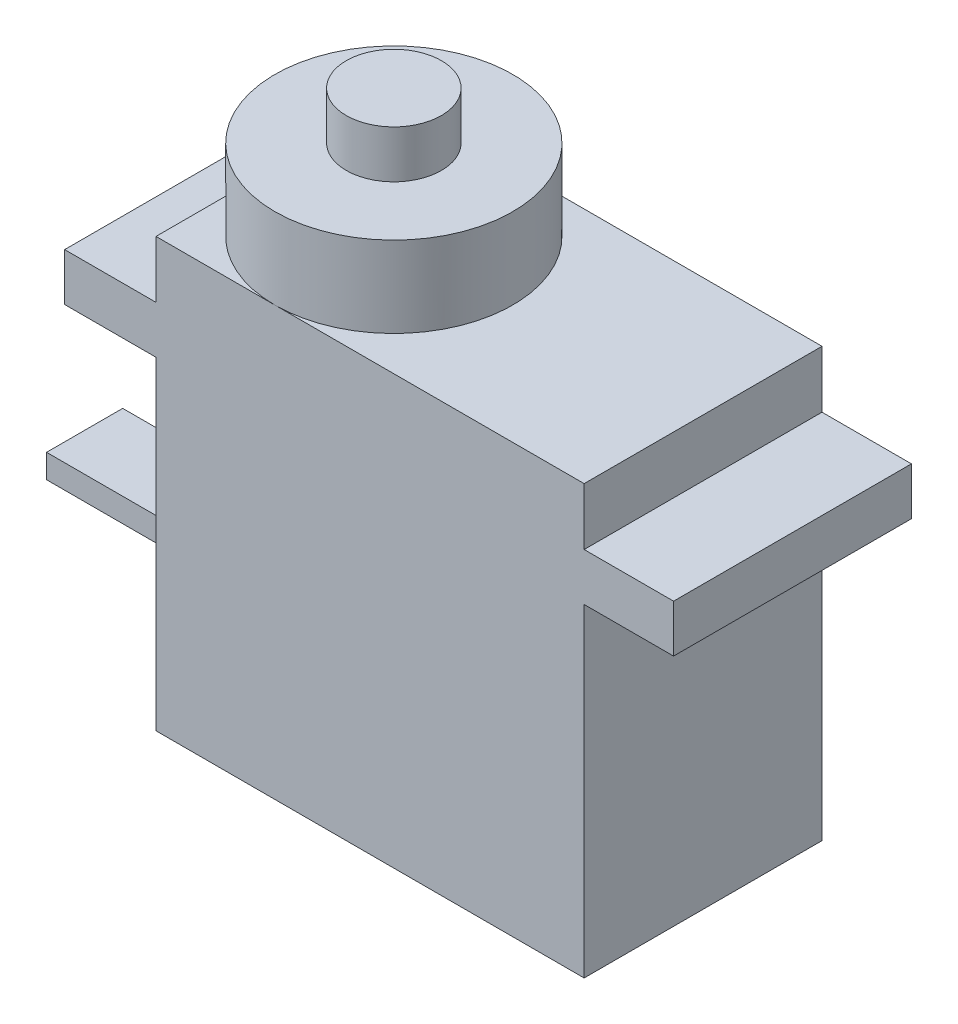
ISO-10303-21;
HEADER;
FILE_DESCRIPTION(('STEP AP214'),'2;1');
FILE_NAME('part.step','',(''),(''),'','','');
FILE_SCHEMA(('AUTOMOTIVE_DESIGN { 1 0 10303 214 1 1 1 1 }'));
ENDSEC;
DATA;
#1=APPLICATION_CONTEXT('core data for automotive mechanical design processes');
#2=APPLICATION_PROTOCOL_DEFINITION('international standard','automotive_design',2000,#1);
#3=PRODUCT_CONTEXT('',#1,'mechanical');
#4=PRODUCT('Part','Part','',(#3));
#5=PRODUCT_RELATED_PRODUCT_CATEGORY('part','',(#4));
#6=PRODUCT_DEFINITION_FORMATION('','',#4);
#7=PRODUCT_DEFINITION_CONTEXT('part definition',#1,'design');
#8=PRODUCT_DEFINITION('design','',#6,#7);
#9=PRODUCT_DEFINITION_SHAPE('','',#8);
#10=(LENGTH_UNIT() NAMED_UNIT(*) SI_UNIT(.MILLI.,.METRE.));
#11=(NAMED_UNIT(*) PLANE_ANGLE_UNIT() SI_UNIT($,.RADIAN.));
#12=(NAMED_UNIT(*) SI_UNIT($,.STERADIAN.) SOLID_ANGLE_UNIT());
#13=UNCERTAINTY_MEASURE_WITH_UNIT(LENGTH_MEASURE(1.E-05),#10,'distance_accuracy_value','');
#14=(GEOMETRIC_REPRESENTATION_CONTEXT(3) GLOBAL_UNCERTAINTY_ASSIGNED_CONTEXT((#13)) GLOBAL_UNIT_ASSIGNED_CONTEXT((#10,
#11,#12)) REPRESENTATION_CONTEXT('',''));
#15=CARTESIAN_POINT('',(0.,0.,0.));
#16=DIRECTION('',(0.,0.,1.));
#17=DIRECTION('',(1.,0.,0.));
#18=AXIS2_PLACEMENT_3D('',#15,#16,#17);
#19=CARTESIAN_POINT('',(0.,22.5,0.));
#20=DIRECTION('',(-1.,0.,0.));
#21=DIRECTION('',(0.,0.,1.));
#22=AXIS2_PLACEMENT_3D('',#19,#20,#21);
#23=PLANE('',#22);
#24=DIRECTION('',(0.,-1.,0.));
#25=VECTOR('',#24,1.);
#26=CARTESIAN_POINT('',(0.,22.5,0.));
#27=LINE('',#26,#25);
#28=CARTESIAN_POINT('',(0.,17.,0.));
#29=VERTEX_POINT('',#28);
#30=CARTESIAN_POINT('',(0.,0.,0.));
#31=VERTEX_POINT('',#30);
#32=EDGE_CURVE('E269',#29,#31,#27,.T.);
#33=ORIENTED_EDGE('',*,*,#32,.F.);
#34=DIRECTION('',(0.,0.,-1.));
#35=VECTOR('',#34,1.);
#36=CARTESIAN_POINT('',(0.,17.,0.));
#37=LINE('',#36,#35);
#38=CARTESIAN_POINT('',(0.,17.,-12.5));
#39=VERTEX_POINT('',#38);
#40=EDGE_CURVE('E247',#29,#39,#37,.T.);
#41=ORIENTED_EDGE('',*,*,#40,.T.);
#42=DIRECTION('',(0.,-1.,0.));
#43=VECTOR('',#42,1.);
#44=CARTESIAN_POINT('',(0.,22.5,-12.5));
#45=LINE('',#44,#43);
#46=CARTESIAN_POINT('',(0.,0.,-12.5));
#47=VERTEX_POINT('',#46);
#48=EDGE_CURVE('E284',#39,#47,#45,.T.);
#49=ORIENTED_EDGE('',*,*,#48,.T.);
#50=DIRECTION('',(0.,0.,-1.));
#51=VECTOR('',#50,1.);
#52=CARTESIAN_POINT('',(0.,0.,0.));
#53=LINE('',#52,#51);
#54=EDGE_CURVE('E278',#31,#47,#53,.T.);
#55=ORIENTED_EDGE('',*,*,#54,.F.);
#56=EDGE_LOOP('',(#33,#41,#49,#55));
#57=FACE_BOUND('',#56,.T.);
#58=DIRECTION('',(0.,0.,1.));
#59=VECTOR('',#58,1.);
#60=CARTESIAN_POINT('',(0.,4.3,-8.25));
#61=LINE('',#60,#59);
#62=CARTESIAN_POINT('',(0.,4.3,-8.25));
#63=VERTEX_POINT('',#62);
#64=CARTESIAN_POINT('',(0.,4.3,-4.25));
#65=VERTEX_POINT('',#64);
#66=EDGE_CURVE('E534',#63,#65,#61,.T.);
#67=ORIENTED_EDGE('',*,*,#66,.F.);
#68=DIRECTION('',(0.,-1.,0.));
#69=VECTOR('',#68,1.);
#70=CARTESIAN_POINT('',(0.,4.3,-8.25));
#71=LINE('',#70,#69);
#72=CARTESIAN_POINT('',(0.,5.55,-8.25));
#73=VERTEX_POINT('',#72);
#74=EDGE_CURVE('E187',#73,#63,#71,.T.);
#75=ORIENTED_EDGE('',*,*,#74,.F.);
#76=DIRECTION('',(0.,0.,-1.));
#77=VECTOR('',#76,1.);
#78=CARTESIAN_POINT('',(0.,5.55,-8.25));
#79=LINE('',#78,#77);
#80=CARTESIAN_POINT('',(0.,5.55,-4.25));
#81=VERTEX_POINT('',#80);
#82=EDGE_CURVE('E183',#81,#73,#79,.T.);
#83=ORIENTED_EDGE('',*,*,#82,.F.);
#84=DIRECTION('',(0.,1.,0.));
#85=VECTOR('',#84,1.);
#86=CARTESIAN_POINT('',(0.,4.3,-4.25));
#87=LINE('',#86,#85);
#88=EDGE_CURVE('E531',#65,#81,#87,.T.);
#89=ORIENTED_EDGE('',*,*,#88,.F.);
#90=EDGE_LOOP('',(#67,#75,#83,#89));
#91=FACE_BOUND('',#90,.T.);
#92=ADVANCED_FACE('F39',(#57,#91),#23,.T.);
#93=CARTESIAN_POINT('',(0.,22.5,0.));
#94=DIRECTION('',(0.,1.,0.));
#95=DIRECTION('',(0.,0.,1.));
#96=AXIS2_PLACEMENT_3D('',#93,#94,#95);
#97=PLANE('',#96);
#98=CARTESIAN_POINT('',(6.25,22.5,-6.25));
#99=DIRECTION('',(0.,1.,0.));
#100=DIRECTION('',(0.,0.,1.));
#101=AXIS2_PLACEMENT_3D('',#98,#99,#100);
#102=CIRCLE('',#101,6.25);
#103=CARTESIAN_POINT('',(6.25,22.5,0.));
#104=VERTEX_POINT('',#103);
#105=CARTESIAN_POINT('',(6.25,22.5,-12.5));
#106=VERTEX_POINT('',#105);
#107=EDGE_CURVE('E50',#104,#106,#102,.T.);
#108=ORIENTED_EDGE('',*,*,#107,.F.);
#109=DIRECTION('',(1.,0.,0.));
#110=VECTOR('',#109,1.);
#111=CARTESIAN_POINT('',(0.,22.5,0.));
#112=LINE('',#111,#110);
#113=CARTESIAN_POINT('',(22.5,22.5,0.));
#114=VERTEX_POINT('',#113);
#115=EDGE_CURVE('E258',#104,#114,#112,.T.);
#116=ORIENTED_EDGE('',*,*,#115,.T.);
#117=DIRECTION('',(0.,0.,-1.));
#118=VECTOR('',#117,1.);
#119=CARTESIAN_POINT('',(22.5,22.5,0.));
#120=LINE('',#119,#118);
#121=CARTESIAN_POINT('',(22.5,22.5,-12.5));
#122=VERTEX_POINT('',#121);
#123=EDGE_CURVE('E257',#114,#122,#120,.T.);
#124=ORIENTED_EDGE('',*,*,#123,.T.);
#125=DIRECTION('',(1.,0.,0.));
#126=VECTOR('',#125,1.);
#127=CARTESIAN_POINT('',(0.,22.5,-12.5));
#128=LINE('',#127,#126);
#129=EDGE_CURVE('E261',#106,#122,#128,.T.);
#130=ORIENTED_EDGE('',*,*,#129,.F.);
#131=EDGE_LOOP('',(#108,#116,#124,#130));
#132=FACE_BOUND('',#131,.T.);
#133=ADVANCED_FACE('F337',(#132),#97,.T.);
#134=CARTESIAN_POINT('',(0.,22.5,-6.25));
#135=VERTEX_POINT('',#134);
#136=EDGE_CURVE('E11',#106,#135,#102,.T.);
#137=ORIENTED_EDGE('',*,*,#136,.F.);
#138=CARTESIAN_POINT('',(0.,22.5,-12.5));
#139=VERTEX_POINT('',#138);
#140=EDGE_CURVE('E262',#139,#106,#128,.T.);
#141=ORIENTED_EDGE('',*,*,#140,.F.);
#142=DIRECTION('',(0.,0.,-1.));
#143=VECTOR('',#142,1.);
#144=CARTESIAN_POINT('',(0.,22.5,0.));
#145=LINE('',#144,#143);
#146=EDGE_CURVE('E265',#135,#139,#145,.T.);
#147=ORIENTED_EDGE('',*,*,#146,.F.);
#148=EDGE_LOOP('',(#137,#141,#147));
#149=FACE_BOUND('',#148,.T.);
#150=ADVANCED_FACE('F343',(#149),#97,.T.);
#151=CARTESIAN_POINT('',(22.5,22.5,0.));
#152=DIRECTION('',(-1.,0.,0.));
#153=DIRECTION('',(0.,0.,1.));
#154=AXIS2_PLACEMENT_3D('',#151,#152,#153);
#155=PLANE('',#154);
#156=DIRECTION('',(0.,0.,-1.));
#157=VECTOR('',#156,1.);
#158=CARTESIAN_POINT('',(22.5,17.,0.));
#159=LINE('',#158,#157);
#160=CARTESIAN_POINT('',(22.5,17.,0.));
#161=VERTEX_POINT('',#160);
#162=CARTESIAN_POINT('',(22.5,17.,-12.5));
#163=VERTEX_POINT('',#162);
#164=EDGE_CURVE('E205',#161,#163,#159,.T.);
#165=ORIENTED_EDGE('',*,*,#164,.F.);
#166=DIRECTION('',(0.,-1.,0.));
#167=VECTOR('',#166,1.);
#168=CARTESIAN_POINT('',(22.5,22.5,0.));
#169=LINE('',#168,#167);
#170=CARTESIAN_POINT('',(22.5,0.,0.));
#171=VERTEX_POINT('',#170);
#172=EDGE_CURVE('E290',#161,#171,#169,.T.);
#173=ORIENTED_EDGE('',*,*,#172,.T.);
#174=DIRECTION('',(0.,0.,-1.));
#175=VECTOR('',#174,1.);
#176=CARTESIAN_POINT('',(22.5,0.,0.));
#177=LINE('',#176,#175);
#178=CARTESIAN_POINT('',(22.5,0.,-12.5));
#179=VERTEX_POINT('',#178);
#180=EDGE_CURVE('E272',#171,#179,#177,.T.);
#181=ORIENTED_EDGE('',*,*,#180,.T.);
#182=DIRECTION('',(0.,-1.,0.));
#183=VECTOR('',#182,1.);
#184=CARTESIAN_POINT('',(22.5,22.5,-12.5));
#185=LINE('',#184,#183);
#186=EDGE_CURVE('E287',#163,#179,#185,.T.);
#187=ORIENTED_EDGE('',*,*,#186,.F.);
#188=EDGE_LOOP('',(#165,#173,#181,#187));
#189=FACE_BOUND('',#188,.T.);
#190=ADVANCED_FACE('F300',(#189),#155,.F.);
#191=CARTESIAN_POINT('',(0.,22.5,0.));
#192=DIRECTION('',(0.,0.,-1.));
#193=DIRECTION('',(-1.,0.,0.));
#194=AXIS2_PLACEMENT_3D('',#191,#192,#193);
#195=PLANE('',#194);
#196=DIRECTION('',(1.,0.,0.));
#197=VECTOR('',#196,1.);
#198=CARTESIAN_POINT('',(0.,0.,0.));
#199=LINE('',#198,#197);
#200=EDGE_CURVE('E254',#31,#171,#199,.T.);
#201=ORIENTED_EDGE('',*,*,#200,.T.);
#202=ORIENTED_EDGE('',*,*,#172,.F.);
#203=DIRECTION('',(1.,0.,0.));
#204=VECTOR('',#203,1.);
#205=CARTESIAN_POINT('',(0.,17.,0.));
#206=LINE('',#205,#204);
#207=CARTESIAN_POINT('',(27.2,17.,0.));
#208=VERTEX_POINT('',#207);
#209=EDGE_CURVE('E198',#161,#208,#206,.T.);
#210=ORIENTED_EDGE('',*,*,#209,.T.);
#211=DIRECTION('',(0.,-1.,0.));
#212=VECTOR('',#211,1.);
#213=CARTESIAN_POINT('',(27.2,19.5,0.));
#214=LINE('',#213,#212);
#215=CARTESIAN_POINT('',(27.2,19.5,0.));
#216=VERTEX_POINT('',#215);
#217=EDGE_CURVE('E225',#216,#208,#214,.T.);
#218=ORIENTED_EDGE('',*,*,#217,.F.);
#219=DIRECTION('',(1.,0.,0.));
#220=VECTOR('',#219,1.);
#221=CARTESIAN_POINT('',(0.,19.5,0.));
#222=LINE('',#221,#220);
#223=CARTESIAN_POINT('',(22.5,19.5,0.));
#224=VERTEX_POINT('',#223);
#225=EDGE_CURVE('E201',#224,#216,#222,.T.);
#226=ORIENTED_EDGE('',*,*,#225,.F.);
#227=EDGE_CURVE('E291',#114,#224,#169,.T.);
#228=ORIENTED_EDGE('',*,*,#227,.F.);
#229=ORIENTED_EDGE('',*,*,#115,.F.);
#230=CARTESIAN_POINT('',(0.,22.5,0.));
#231=VERTEX_POINT('',#230);
#232=EDGE_CURVE('E255',#231,#104,#112,.T.);
#233=ORIENTED_EDGE('',*,*,#232,.F.);
#234=CARTESIAN_POINT('',(0.,19.5,0.));
#235=VERTEX_POINT('',#234);
#236=EDGE_CURVE('E281',#231,#235,#27,.T.);
#237=ORIENTED_EDGE('',*,*,#236,.T.);
#238=DIRECTION('',(-1.,0.,0.));
#239=VECTOR('',#238,1.);
#240=CARTESIAN_POINT('',(0.,19.5,0.));
#241=LINE('',#240,#239);
#242=CARTESIAN_POINT('',(-4.8,19.5,0.));
#243=VERTEX_POINT('',#242);
#244=EDGE_CURVE('E232',#235,#243,#241,.T.);
#245=ORIENTED_EDGE('',*,*,#244,.T.);
#246=DIRECTION('',(0.,-1.,0.));
#247=VECTOR('',#246,1.);
#248=CARTESIAN_POINT('',(-4.8,19.5,0.));
#249=LINE('',#248,#247);
#250=CARTESIAN_POINT('',(-4.8,17.,0.));
#251=VERTEX_POINT('',#250);
#252=EDGE_CURVE('E252',#243,#251,#249,.T.);
#253=ORIENTED_EDGE('',*,*,#252,.T.);
#254=DIRECTION('',(-1.,0.,0.));
#255=VECTOR('',#254,1.);
#256=CARTESIAN_POINT('',(0.,17.,0.));
#257=LINE('',#256,#255);
#258=EDGE_CURVE('E244',#29,#251,#257,.T.);
#259=ORIENTED_EDGE('',*,*,#258,.F.);
#260=ORIENTED_EDGE('',*,*,#32,.T.);
#261=EDGE_LOOP('',(#201,#202,#210,#218,#226,#228,#229,#233,#237,#245,#253,#259,#260));
#262=FACE_BOUND('',#261,.T.);
#263=ADVANCED_FACE('F41',(#262),#195,.F.);
#264=ORIENTED_EDGE('',*,*,#227,.T.);
#265=DIRECTION('',(0.,0.,-1.));
#266=VECTOR('',#265,1.);
#267=CARTESIAN_POINT('',(22.5,19.5,0.));
#268=LINE('',#267,#266);
#269=CARTESIAN_POINT('',(22.5,19.5,-12.5));
#270=VERTEX_POINT('',#269);
#271=EDGE_CURVE('E210',#224,#270,#268,.T.);
#272=ORIENTED_EDGE('',*,*,#271,.T.);
#273=EDGE_CURVE('E288',#122,#270,#185,.T.);
#274=ORIENTED_EDGE('',*,*,#273,.F.);
#275=ORIENTED_EDGE('',*,*,#123,.F.);
#276=EDGE_LOOP('',(#264,#272,#274,#275));
#277=FACE_BOUND('',#276,.T.);
#278=ADVANCED_FACE('F331',(#277),#155,.F.);
#279=CARTESIAN_POINT('',(0.,22.5,-12.5));
#280=DIRECTION('',(0.,0.,-1.));
#281=DIRECTION('',(-1.,0.,0.));
#282=AXIS2_PLACEMENT_3D('',#279,#280,#281);
#283=PLANE('',#282);
#284=DIRECTION('',(1.,0.,0.));
#285=VECTOR('',#284,1.);
#286=CARTESIAN_POINT('',(0.,0.,-12.5));
#287=LINE('',#286,#285);
#288=EDGE_CURVE('E275',#47,#179,#287,.T.);
#289=ORIENTED_EDGE('',*,*,#288,.F.);
#290=ORIENTED_EDGE('',*,*,#48,.F.);
#291=DIRECTION('',(-1.,0.,0.));
#292=VECTOR('',#291,1.);
#293=CARTESIAN_POINT('',(0.,17.,-12.5));
#294=LINE('',#293,#292);
#295=CARTESIAN_POINT('',(-4.8,17.,-12.5));
#296=VERTEX_POINT('',#295);
#297=EDGE_CURVE('E233',#39,#296,#294,.T.);
#298=ORIENTED_EDGE('',*,*,#297,.T.);
#299=DIRECTION('',(0.,-1.,0.));
#300=VECTOR('',#299,1.);
#301=CARTESIAN_POINT('',(-4.8,19.5,-12.5));
#302=LINE('',#301,#300);
#303=CARTESIAN_POINT('',(-4.8,19.5,-12.5));
#304=VERTEX_POINT('',#303);
#305=EDGE_CURVE('E241',#304,#296,#302,.T.);
#306=ORIENTED_EDGE('',*,*,#305,.F.);
#307=DIRECTION('',(-1.,0.,0.));
#308=VECTOR('',#307,1.);
#309=CARTESIAN_POINT('',(0.,19.5,-12.5));
#310=LINE('',#309,#308);
#311=CARTESIAN_POINT('',(0.,19.5,-12.5));
#312=VERTEX_POINT('',#311);
#313=EDGE_CURVE('E239',#312,#304,#310,.T.);
#314=ORIENTED_EDGE('',*,*,#313,.F.);
#315=EDGE_CURVE('E285',#139,#312,#45,.T.);
#316=ORIENTED_EDGE('',*,*,#315,.F.);
#317=ORIENTED_EDGE('',*,*,#140,.T.);
#318=ORIENTED_EDGE('',*,*,#129,.T.);
#319=ORIENTED_EDGE('',*,*,#273,.T.);
#320=DIRECTION('',(1.,0.,0.));
#321=VECTOR('',#320,1.);
#322=CARTESIAN_POINT('',(0.,19.5,-12.5));
#323=LINE('',#322,#321);
#324=CARTESIAN_POINT('',(27.2,19.5,-12.5));
#325=VERTEX_POINT('',#324);
#326=EDGE_CURVE('E207',#270,#325,#323,.T.);
#327=ORIENTED_EDGE('',*,*,#326,.T.);
#328=DIRECTION('',(0.,-1.,0.));
#329=VECTOR('',#328,1.);
#330=CARTESIAN_POINT('',(27.2,19.5,-12.5));
#331=LINE('',#330,#329);
#332=CARTESIAN_POINT('',(27.2,17.,-12.5));
#333=VERTEX_POINT('',#332);
#334=EDGE_CURVE('E213',#325,#333,#331,.T.);
#335=ORIENTED_EDGE('',*,*,#334,.T.);
#336=DIRECTION('',(1.,0.,0.));
#337=VECTOR('',#336,1.);
#338=CARTESIAN_POINT('',(0.,17.,-12.5));
#339=LINE('',#338,#337);
#340=EDGE_CURVE('E219',#163,#333,#339,.T.);
#341=ORIENTED_EDGE('',*,*,#340,.F.);
#342=ORIENTED_EDGE('',*,*,#186,.T.);
#343=EDGE_LOOP('',(#289,#290,#298,#306,#314,#316,#317,#318,#319,#327,#335,#341,#342));
#344=FACE_BOUND('',#343,.T.);
#345=ADVANCED_FACE('F319',(#344),#283,.T.);
#346=DIRECTION('',(0.,0.,-1.));
#347=VECTOR('',#346,1.);
#348=CARTESIAN_POINT('',(0.,19.5,0.));
#349=LINE('',#348,#347);
#350=EDGE_CURVE('E236',#235,#312,#349,.T.);
#351=ORIENTED_EDGE('',*,*,#350,.F.);
#352=ORIENTED_EDGE('',*,*,#236,.F.);
#353=EDGE_CURVE('E266',#231,#135,#145,.T.);
#354=ORIENTED_EDGE('',*,*,#353,.T.);
#355=ORIENTED_EDGE('',*,*,#146,.T.);
#356=ORIENTED_EDGE('',*,*,#315,.T.);
#357=EDGE_LOOP('',(#351,#352,#354,#355,#356));
#358=FACE_BOUND('',#357,.T.);
#359=ADVANCED_FACE('F345',(#358),#23,.T.);
#360=EDGE_CURVE('E48',#135,#104,#102,.T.);
#361=ORIENTED_EDGE('',*,*,#360,.F.);
#362=ORIENTED_EDGE('',*,*,#353,.F.);
#363=ORIENTED_EDGE('',*,*,#232,.T.);
#364=EDGE_LOOP('',(#361,#362,#363));
#365=FACE_BOUND('',#364,.T.);
#366=ADVANCED_FACE('F346',(#365),#97,.T.);
#367=CARTESIAN_POINT('',(0.,0.,0.));
#368=DIRECTION('',(0.,1.,0.));
#369=DIRECTION('',(0.,0.,1.));
#370=AXIS2_PLACEMENT_3D('',#367,#368,#369);
#371=PLANE('',#370);
#372=ORIENTED_EDGE('',*,*,#200,.F.);
#373=ORIENTED_EDGE('',*,*,#54,.T.);
#374=ORIENTED_EDGE('',*,*,#288,.T.);
#375=ORIENTED_EDGE('',*,*,#180,.F.);
#376=EDGE_LOOP('',(#372,#373,#374,#375));
#377=FACE_BOUND('',#376,.T.);
#378=ADVANCED_FACE('F305',(#377),#371,.F.);
#379=CARTESIAN_POINT('',(-4.8,19.5,0.));
#380=DIRECTION('',(-1.,0.,0.));
#381=DIRECTION('',(0.,0.,1.));
#382=AXIS2_PLACEMENT_3D('',#379,#380,#381);
#383=PLANE('',#382);
#384=DIRECTION('',(0.,0.,-1.));
#385=VECTOR('',#384,1.);
#386=CARTESIAN_POINT('',(-4.8,17.,0.));
#387=LINE('',#386,#385);
#388=EDGE_CURVE('E228',#251,#296,#387,.T.);
#389=ORIENTED_EDGE('',*,*,#388,.F.);
#390=ORIENTED_EDGE('',*,*,#252,.F.);
#391=DIRECTION('',(0.,0.,-1.));
#392=VECTOR('',#391,1.);
#393=CARTESIAN_POINT('',(-4.8,19.5,0.));
#394=LINE('',#393,#392);
#395=EDGE_CURVE('E229',#243,#304,#394,.T.);
#396=ORIENTED_EDGE('',*,*,#395,.T.);
#397=ORIENTED_EDGE('',*,*,#305,.T.);
#398=EDGE_LOOP('',(#389,#390,#396,#397));
#399=FACE_BOUND('',#398,.T.);
#400=ADVANCED_FACE('F354',(#399),#383,.T.);
#401=CARTESIAN_POINT('',(0.,19.5,0.));
#402=DIRECTION('',(0.,1.,0.));
#403=DIRECTION('',(0.,0.,1.));
#404=AXIS2_PLACEMENT_3D('',#401,#402,#403);
#405=PLANE('',#404);
#406=ORIENTED_EDGE('',*,*,#395,.F.);
#407=ORIENTED_EDGE('',*,*,#244,.F.);
#408=ORIENTED_EDGE('',*,*,#350,.T.);
#409=ORIENTED_EDGE('',*,*,#313,.T.);
#410=EDGE_LOOP('',(#406,#407,#408,#409));
#411=FACE_BOUND('',#410,.T.);
#412=ADVANCED_FACE('F397',(#411),#405,.T.);
#413=CARTESIAN_POINT('',(0.,17.,0.));
#414=DIRECTION('',(0.,1.,0.));
#415=DIRECTION('',(0.,0.,1.));
#416=AXIS2_PLACEMENT_3D('',#413,#414,#415);
#417=PLANE('',#416);
#418=ORIENTED_EDGE('',*,*,#388,.T.);
#419=ORIENTED_EDGE('',*,*,#297,.F.);
#420=ORIENTED_EDGE('',*,*,#40,.F.);
#421=ORIENTED_EDGE('',*,*,#258,.T.);
#422=EDGE_LOOP('',(#418,#419,#420,#421));
#423=FACE_BOUND('',#422,.T.);
#424=ADVANCED_FACE('F315',(#423),#417,.F.);
#425=CARTESIAN_POINT('',(27.2,19.5,0.));
#426=DIRECTION('',(-1.,0.,0.));
#427=DIRECTION('',(0.,0.,1.));
#428=AXIS2_PLACEMENT_3D('',#425,#426,#427);
#429=PLANE('',#428);
#430=DIRECTION('',(0.,0.,-1.));
#431=VECTOR('',#430,1.);
#432=CARTESIAN_POINT('',(27.2,17.,0.));
#433=LINE('',#432,#431);
#434=EDGE_CURVE('E216',#208,#333,#433,.T.);
#435=ORIENTED_EDGE('',*,*,#434,.T.);
#436=ORIENTED_EDGE('',*,*,#334,.F.);
#437=DIRECTION('',(0.,0.,-1.));
#438=VECTOR('',#437,1.);
#439=CARTESIAN_POINT('',(27.2,19.5,0.));
#440=LINE('',#439,#438);
#441=EDGE_CURVE('E204',#216,#325,#440,.T.);
#442=ORIENTED_EDGE('',*,*,#441,.F.);
#443=ORIENTED_EDGE('',*,*,#217,.T.);
#444=EDGE_LOOP('',(#435,#436,#442,#443));
#445=FACE_BOUND('',#444,.T.);
#446=ADVANCED_FACE('F327',(#445),#429,.F.);
#447=CARTESIAN_POINT('',(0.,19.5,0.));
#448=DIRECTION('',(0.,1.,0.));
#449=DIRECTION('',(0.,0.,1.));
#450=AXIS2_PLACEMENT_3D('',#447,#448,#449);
#451=PLANE('',#450);
#452=ORIENTED_EDGE('',*,*,#225,.T.);
#453=ORIENTED_EDGE('',*,*,#441,.T.);
#454=ORIENTED_EDGE('',*,*,#326,.F.);
#455=ORIENTED_EDGE('',*,*,#271,.F.);
#456=EDGE_LOOP('',(#452,#453,#454,#455));
#457=FACE_BOUND('',#456,.T.);
#458=ADVANCED_FACE('F329',(#457),#451,.T.);
#459=CARTESIAN_POINT('',(0.,17.,0.));
#460=DIRECTION('',(0.,1.,0.));
#461=DIRECTION('',(0.,0.,1.));
#462=AXIS2_PLACEMENT_3D('',#459,#460,#461);
#463=PLANE('',#462);
#464=ORIENTED_EDGE('',*,*,#209,.F.);
#465=ORIENTED_EDGE('',*,*,#164,.T.);
#466=ORIENTED_EDGE('',*,*,#340,.T.);
#467=ORIENTED_EDGE('',*,*,#434,.F.);
#468=EDGE_LOOP('',(#464,#465,#466,#467));
#469=FACE_BOUND('',#468,.T.);
#470=ADVANCED_FACE('F323',(#469),#463,.F.);
#471=CARTESIAN_POINT('',(6.25,26.75,-6.25));
#472=DIRECTION('',(0.,-1.,0.));
#473=DIRECTION('',(0.,0.,-1.));
#474=AXIS2_PLACEMENT_3D('',#471,#472,#473);
#475=CYLINDRICAL_SURFACE('',#474,6.25);
#476=CARTESIAN_POINT('',(6.25,26.75,-6.25));
#477=DIRECTION('',(0.,1.,0.));
#478=DIRECTION('',(0.,0.,1.));
#479=AXIS2_PLACEMENT_3D('',#476,#477,#478);
#480=CIRCLE('',#479,6.25);
#481=CARTESIAN_POINT('',(6.25,26.75,0.));
#482=VERTEX_POINT('',#481);
#483=EDGE_CURVE('E196',#482,#482,#480,.T.);
#484=ORIENTED_EDGE('',*,*,#483,.F.);
#485=EDGE_LOOP('',(#484));
#486=FACE_BOUND('',#485,.T.);
#487=ORIENTED_EDGE('',*,*,#107,.T.);
#488=ORIENTED_EDGE('',*,*,#136,.T.);
#489=ORIENTED_EDGE('',*,*,#360,.T.);
#490=EDGE_LOOP('',(#487,#488,#489));
#491=FACE_BOUND('',#490,.T.);
#492=ADVANCED_FACE('F341',(#486,#491),#475,.T.);
#493=CARTESIAN_POINT('',(0.,26.75,0.));
#494=DIRECTION('',(0.,1.,0.));
#495=DIRECTION('',(0.,0.,1.));
#496=AXIS2_PLACEMENT_3D('',#493,#494,#495);
#497=PLANE('',#496);
#498=CARTESIAN_POINT('',(6.25,26.75,-6.25));
#499=DIRECTION('',(0.,1.,0.));
#500=DIRECTION('',(0.,0.,1.));
#501=AXIS2_PLACEMENT_3D('',#498,#499,#500);
#502=CIRCLE('',#501,2.5);
#503=CARTESIAN_POINT('',(6.25,26.75,-3.75));
#504=VERTEX_POINT('',#503);
#505=EDGE_CURVE('E43',#504,#504,#502,.F.);
#506=ORIENTED_EDGE('',*,*,#505,.T.);
#507=EDGE_LOOP('',(#506));
#508=FACE_BOUND('',#507,.T.);
#509=ORIENTED_EDGE('',*,*,#483,.T.);
#510=EDGE_LOOP('',(#509));
#511=FACE_BOUND('',#510,.T.);
#512=ADVANCED_FACE('F452',(#508,#511),#497,.T.);
#513=CARTESIAN_POINT('',(6.25,29.25,-6.25));
#514=DIRECTION('',(0.,-1.,0.));
#515=DIRECTION('',(0.,0.,-1.));
#516=AXIS2_PLACEMENT_3D('',#513,#514,#515);
#517=CYLINDRICAL_SURFACE('',#516,2.5);
#518=ORIENTED_EDGE('',*,*,#505,.F.);
#519=EDGE_LOOP('',(#518));
#520=FACE_BOUND('',#519,.T.);
#521=CARTESIAN_POINT('',(6.25,29.25,-6.25));
#522=DIRECTION('',(0.,1.,0.));
#523=DIRECTION('',(0.,0.,1.));
#524=AXIS2_PLACEMENT_3D('',#521,#522,#523);
#525=CIRCLE('',#524,2.5);
#526=CARTESIAN_POINT('',(6.25,29.25,-3.75));
#527=VERTEX_POINT('',#526);
#528=EDGE_CURVE('E189',#527,#527,#525,.T.);
#529=ORIENTED_EDGE('',*,*,#528,.F.);
#530=EDGE_LOOP('',(#529));
#531=FACE_BOUND('',#530,.T.);
#532=ADVANCED_FACE('F461',(#520,#531),#517,.T.);
#533=CARTESIAN_POINT('',(0.,29.25,0.));
#534=DIRECTION('',(0.,1.,0.));
#535=DIRECTION('',(0.,0.,1.));
#536=AXIS2_PLACEMENT_3D('',#533,#534,#535);
#537=PLANE('',#536);
#538=ORIENTED_EDGE('',*,*,#528,.T.);
#539=EDGE_LOOP('',(#538));
#540=FACE_BOUND('',#539,.T.);
#541=ADVANCED_FACE('F470',(#540),#537,.T.);
#542=CARTESIAN_POINT('',(-10.,4.3,-8.25));
#543=DIRECTION('',(0.,0.,1.));
#544=DIRECTION('',(1.,0.,0.));
#545=AXIS2_PLACEMENT_3D('',#542,#543,#544);
#546=PLANE('',#545);
#547=ORIENTED_EDGE('',*,*,#74,.T.);
#548=DIRECTION('',(1.,0.,0.));
#549=VECTOR('',#548,1.);
#550=CARTESIAN_POINT('',(-10.,4.3,-8.25));
#551=LINE('',#550,#549);
#552=CARTESIAN_POINT('',(-10.,4.3,-8.25));
#553=VERTEX_POINT('',#552);
#554=EDGE_CURVE('E168',#553,#63,#551,.T.);
#555=ORIENTED_EDGE('',*,*,#554,.F.);
#556=DIRECTION('',(0.,-1.,0.));
#557=VECTOR('',#556,1.);
#558=CARTESIAN_POINT('',(-10.,4.3,-8.25));
#559=LINE('',#558,#557);
#560=CARTESIAN_POINT('',(-10.,5.55,-8.25));
#561=VERTEX_POINT('',#560);
#562=EDGE_CURVE('E175',#561,#553,#559,.T.);
#563=ORIENTED_EDGE('',*,*,#562,.F.);
#564=DIRECTION('',(1.,0.,0.));
#565=VECTOR('',#564,1.);
#566=CARTESIAN_POINT('',(-10.,5.55,-8.25));
#567=LINE('',#566,#565);
#568=EDGE_CURVE('E529',#561,#73,#567,.T.);
#569=ORIENTED_EDGE('',*,*,#568,.T.);
#570=EDGE_LOOP('',(#547,#555,#563,#569));
#571=FACE_BOUND('',#570,.T.);
#572=ADVANCED_FACE('F185',(#571),#546,.F.);
#573=CARTESIAN_POINT('',(-10.,4.3,-8.25));
#574=DIRECTION('',(0.,1.,0.));
#575=DIRECTION('',(0.,0.,1.));
#576=AXIS2_PLACEMENT_3D('',#573,#574,#575);
#577=PLANE('',#576);
#578=ORIENTED_EDGE('',*,*,#66,.T.);
#579=DIRECTION('',(1.,0.,0.));
#580=VECTOR('',#579,1.);
#581=CARTESIAN_POINT('',(-10.,4.3,-4.25));
#582=LINE('',#581,#580);
#583=CARTESIAN_POINT('',(-10.,4.3,-4.25));
#584=VERTEX_POINT('',#583);
#585=EDGE_CURVE('E171',#584,#65,#582,.T.);
#586=ORIENTED_EDGE('',*,*,#585,.F.);
#587=DIRECTION('',(0.,0.,1.));
#588=VECTOR('',#587,1.);
#589=CARTESIAN_POINT('',(-10.,4.3,-8.25));
#590=LINE('',#589,#588);
#591=EDGE_CURVE('E164',#553,#584,#590,.T.);
#592=ORIENTED_EDGE('',*,*,#591,.F.);
#593=ORIENTED_EDGE('',*,*,#554,.T.);
#594=EDGE_LOOP('',(#578,#586,#592,#593));
#595=FACE_BOUND('',#594,.T.);
#596=ADVANCED_FACE('F166',(#595),#577,.F.);
#597=CARTESIAN_POINT('',(-10.,4.3,-4.25));
#598=DIRECTION('',(0.,0.,-1.));
#599=DIRECTION('',(-1.,0.,0.));
#600=AXIS2_PLACEMENT_3D('',#597,#598,#599);
#601=PLANE('',#600);
#602=ORIENTED_EDGE('',*,*,#88,.T.);
#603=DIRECTION('',(1.,0.,0.));
#604=VECTOR('',#603,1.);
#605=CARTESIAN_POINT('',(-10.,5.55,-4.25));
#606=LINE('',#605,#604);
#607=CARTESIAN_POINT('',(-10.,5.55,-4.25));
#608=VERTEX_POINT('',#607);
#609=EDGE_CURVE('E57',#608,#81,#606,.T.);
#610=ORIENTED_EDGE('',*,*,#609,.F.);
#611=DIRECTION('',(0.,1.,0.));
#612=VECTOR('',#611,1.);
#613=CARTESIAN_POINT('',(-10.,4.3,-4.25));
#614=LINE('',#613,#612);
#615=EDGE_CURVE('E174',#584,#608,#614,.T.);
#616=ORIENTED_EDGE('',*,*,#615,.F.);
#617=ORIENTED_EDGE('',*,*,#585,.T.);
#618=EDGE_LOOP('',(#602,#610,#616,#617));
#619=FACE_BOUND('',#618,.T.);
#620=ADVANCED_FACE('F497',(#619),#601,.F.);
#621=CARTESIAN_POINT('',(-10.,5.55,-8.25));
#622=DIRECTION('',(0.,-1.,0.));
#623=DIRECTION('',(0.,0.,-1.));
#624=AXIS2_PLACEMENT_3D('',#621,#622,#623);
#625=PLANE('',#624);
#626=ORIENTED_EDGE('',*,*,#82,.T.);
#627=ORIENTED_EDGE('',*,*,#568,.F.);
#628=DIRECTION('',(0.,0.,-1.));
#629=VECTOR('',#628,1.);
#630=CARTESIAN_POINT('',(-10.,5.55,-8.25));
#631=LINE('',#630,#629);
#632=EDGE_CURVE('E179',#608,#561,#631,.T.);
#633=ORIENTED_EDGE('',*,*,#632,.F.);
#634=ORIENTED_EDGE('',*,*,#609,.T.);
#635=EDGE_LOOP('',(#626,#627,#633,#634));
#636=FACE_BOUND('',#635,.T.);
#637=ADVANCED_FACE('F505',(#636),#625,.F.);
#638=CARTESIAN_POINT('',(-10.,0.,0.));
#639=DIRECTION('',(1.,0.,0.));
#640=DIRECTION('',(0.,0.,-1.));
#641=AXIS2_PLACEMENT_3D('',#638,#639,#640);
#642=PLANE('',#641);
#643=ORIENTED_EDGE('',*,*,#562,.T.);
#644=ORIENTED_EDGE('',*,*,#591,.T.);
#645=ORIENTED_EDGE('',*,*,#615,.T.);
#646=ORIENTED_EDGE('',*,*,#632,.T.);
#647=EDGE_LOOP('',(#643,#644,#645,#646));
#648=FACE_BOUND('',#647,.T.);
#649=ADVANCED_FACE('F178',(#648),#642,.F.);
#650=CLOSED_SHELL('',(#92,#133,#150,#190,#263,#278,#345,#359,#366,#378,#400,#412,#424,#446,#458,
#470,#492,#512,#532,#541,#572,#596,#620,#637,#649));
#651=MANIFOLD_SOLID_BREP('B2',#650);
#652=ADVANCED_BREP_SHAPE_REPRESENTATION('',(#18,#651),#14);
#653=SHAPE_DEFINITION_REPRESENTATION(#9,#652);
ENDSEC;
END-ISO-10303-21;
